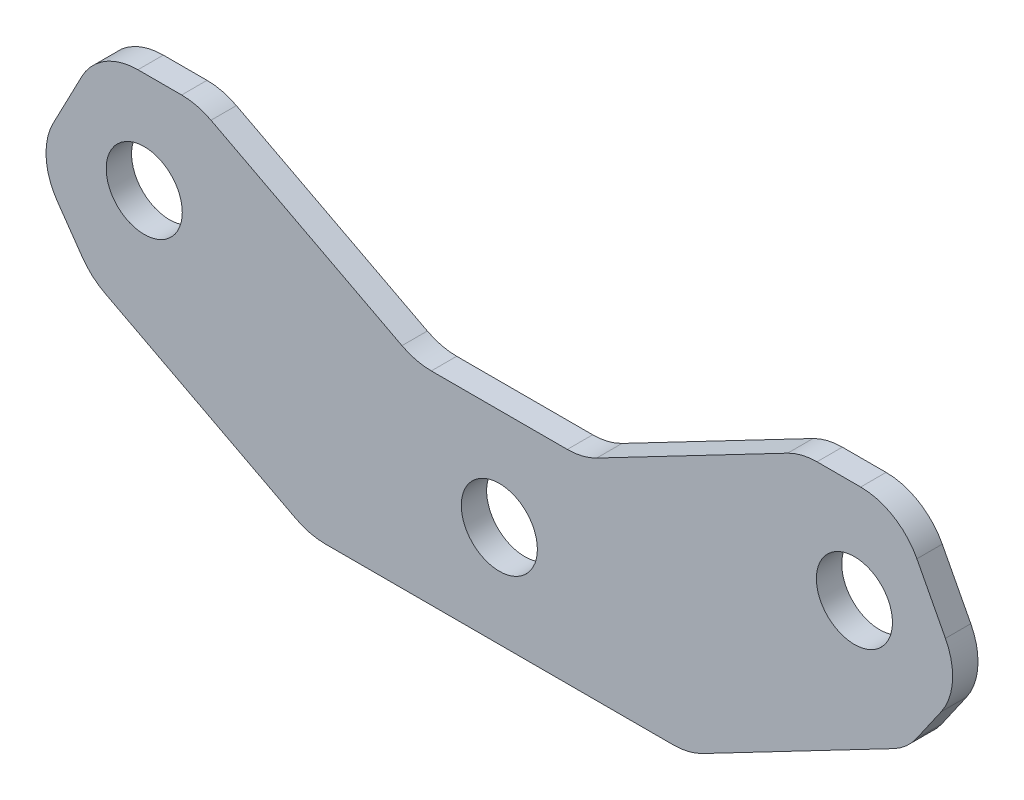
ISO-10303-21;
HEADER;
FILE_DESCRIPTION(('STEP AP214'),'2;1');
FILE_NAME('part.step','',(''),(''),'','','');
FILE_SCHEMA(('AUTOMOTIVE_DESIGN { 1 0 10303 214 1 1 1 1 }'));
ENDSEC;
DATA;
#1=APPLICATION_CONTEXT('core data for automotive mechanical design processes');
#2=APPLICATION_PROTOCOL_DEFINITION('international standard','automotive_design',2000,#1);
#3=PRODUCT_CONTEXT('',#1,'mechanical');
#4=PRODUCT('Part','Part','',(#3));
#5=PRODUCT_RELATED_PRODUCT_CATEGORY('part','',(#4));
#6=PRODUCT_DEFINITION_FORMATION('','',#4);
#7=PRODUCT_DEFINITION_CONTEXT('part definition',#1,'design');
#8=PRODUCT_DEFINITION('design','',#6,#7);
#9=PRODUCT_DEFINITION_SHAPE('','',#8);
#10=(LENGTH_UNIT() NAMED_UNIT(*) SI_UNIT(.MILLI.,.METRE.));
#11=(NAMED_UNIT(*) PLANE_ANGLE_UNIT() SI_UNIT($,.RADIAN.));
#12=(NAMED_UNIT(*) SI_UNIT($,.STERADIAN.) SOLID_ANGLE_UNIT());
#13=UNCERTAINTY_MEASURE_WITH_UNIT(LENGTH_MEASURE(1.E-05),#10,'distance_accuracy_value','');
#14=(GEOMETRIC_REPRESENTATION_CONTEXT(3) GLOBAL_UNCERTAINTY_ASSIGNED_CONTEXT((#13)) GLOBAL_UNIT_ASSIGNED_CONTEXT((#10,
#11,#12)) REPRESENTATION_CONTEXT('',''));
#15=CARTESIAN_POINT('',(0.,0.,0.));
#16=DIRECTION('',(0.,0.,1.));
#17=DIRECTION('',(1.,0.,0.));
#18=AXIS2_PLACEMENT_3D('',#15,#16,#17);
#19=CARTESIAN_POINT('',(0.,8.,2.));
#20=DIRECTION('',(0.,1.,0.));
#21=DIRECTION('',(0.,0.,1.));
#22=AXIS2_PLACEMENT_3D('',#19,#20,#21);
#23=PLANE('',#22);
#24=DIRECTION('',(1.,0.,0.));
#25=VECTOR('',#24,1.);
#26=CARTESIAN_POINT('',(0.,8.,2.));
#27=LINE('',#26,#25);
#28=CARTESIAN_POINT('',(-5.36175130361529,8.,2.));
#29=VERTEX_POINT('',#28);
#30=CARTESIAN_POINT('',(5.36175130361529,8.,2.));
#31=VERTEX_POINT('',#30);
#32=EDGE_CURVE('E345',#29,#31,#27,.T.);
#33=ORIENTED_EDGE('',*,*,#32,.T.);
#34=DIRECTION('',(0.,0.,-1.));
#35=VECTOR('',#34,1.);
#36=CARTESIAN_POINT('',(5.36175130361529,8.,0.));
#37=LINE('',#36,#35);
#38=CARTESIAN_POINT('',(5.36175130361529,8.,0.));
#39=VERTEX_POINT('',#38);
#40=EDGE_CURVE('E300',#31,#39,#37,.T.);
#41=ORIENTED_EDGE('',*,*,#40,.T.);
#42=DIRECTION('',(1.,0.,0.));
#43=VECTOR('',#42,1.);
#44=CARTESIAN_POINT('',(0.,8.,0.));
#45=LINE('',#44,#43);
#46=CARTESIAN_POINT('',(-5.36175130361529,8.,0.));
#47=VERTEX_POINT('',#46);
#48=EDGE_CURVE('E324',#47,#39,#45,.T.);
#49=ORIENTED_EDGE('',*,*,#48,.F.);
#50=DIRECTION('',(0.,0.,-1.));
#51=VECTOR('',#50,1.);
#52=CARTESIAN_POINT('',(-5.36175130361529,8.,2.));
#53=LINE('',#52,#51);
#54=EDGE_CURVE('E298',#47,#29,#53,.F.);
#55=ORIENTED_EDGE('',*,*,#54,.T.);
#56=EDGE_LOOP('',(#33,#41,#49,#55));
#57=FACE_BOUND('',#56,.T.);
#58=ADVANCED_FACE('F35',(#57),#23,.T.);
#59=CARTESIAN_POINT('',(1.87072696465954,3.58208967660546,2.));
#60=DIRECTION('',(-0.462918146168769,-0.886401032235224,0.));
#61=DIRECTION('',(0.886401032235224,-0.462918146168769,0.));
#62=AXIS2_PLACEMENT_3D('',#59,#60,#61);
#63=PLANE('',#62);
#64=DIRECTION('',(-0.886401032235224,0.462918146168769,0.));
#65=VECTOR('',#64,1.);
#66=CARTESIAN_POINT('',(1.87072696465954,3.58208967660546,2.));
#67=LINE('',#66,#65);
#68=CARTESIAN_POINT('',(-7.67634203445913,8.56799483882388,2.));
#69=VERTEX_POINT('',#68);
#70=CARTESIAN_POINT('',(-22.7344401559791,16.4320051611761,2.));
#71=VERTEX_POINT('',#70);
#72=EDGE_CURVE('E343',#69,#71,#67,.T.);
#73=ORIENTED_EDGE('',*,*,#72,.F.);
#74=DIRECTION('',(0.,0.,-1.));
#75=VECTOR('',#74,1.);
#76=CARTESIAN_POINT('',(-7.67634203445913,8.56799483882388,2.));
#77=LINE('',#76,#75);
#78=CARTESIAN_POINT('',(-7.67634203445913,8.56799483882388,0.));
#79=VERTEX_POINT('',#78);
#80=EDGE_CURVE('E305',#69,#79,#77,.T.);
#81=ORIENTED_EDGE('',*,*,#80,.T.);
#82=DIRECTION('',(-0.886401032235224,0.462918146168769,0.));
#83=VECTOR('',#82,1.);
#84=CARTESIAN_POINT('',(1.87072696465954,3.58208967660546,0.));
#85=LINE('',#84,#83);
#86=CARTESIAN_POINT('',(-22.7344401559791,16.4320051611761,0.));
#87=VERTEX_POINT('',#86);
#88=EDGE_CURVE('E326',#79,#87,#85,.T.);
#89=ORIENTED_EDGE('',*,*,#88,.T.);
#90=DIRECTION('',(0.,0.,-1.));
#91=VECTOR('',#90,1.);
#92=CARTESIAN_POINT('',(-22.7344401559791,16.4320051611761,2.));
#93=LINE('',#92,#91);
#94=EDGE_CURVE('E303',#87,#71,#93,.F.);
#95=ORIENTED_EDGE('',*,*,#94,.T.);
#96=EDGE_LOOP('',(#73,#81,#89,#95));
#97=FACE_BOUND('',#96,.T.);
#98=ADVANCED_FACE('F347',(#97),#63,.F.);
#99=CARTESIAN_POINT('',(0.,17.,2.));
#100=DIRECTION('',(0.,-1.,0.));
#101=DIRECTION('',(0.,0.,-1.));
#102=AXIS2_PLACEMENT_3D('',#99,#100,#101);
#103=PLANE('',#102);
#104=DIRECTION('',(-1.,0.,0.));
#105=VECTOR('',#104,1.);
#106=CARTESIAN_POINT('',(0.,17.,2.));
#107=LINE('',#106,#105);
#108=CARTESIAN_POINT('',(-25.049030886823,17.,2.));
#109=VERTEX_POINT('',#108);
#110=CARTESIAN_POINT('',(-28.4956474202711,17.,2.));
#111=VERTEX_POINT('',#110);
#112=EDGE_CURVE('E349',#109,#111,#107,.T.);
#113=ORIENTED_EDGE('',*,*,#112,.F.);
#114=DIRECTION('',(0.,0.,-1.));
#115=VECTOR('',#114,1.);
#116=CARTESIAN_POINT('',(-25.049030886823,17.,2.));
#117=LINE('',#116,#115);
#118=CARTESIAN_POINT('',(-25.049030886823,17.,0.));
#119=VERTEX_POINT('',#118);
#120=EDGE_CURVE('E310',#109,#119,#117,.T.);
#121=ORIENTED_EDGE('',*,*,#120,.T.);
#122=DIRECTION('',(-1.,0.,0.));
#123=VECTOR('',#122,1.);
#124=CARTESIAN_POINT('',(0.,17.,0.));
#125=LINE('',#124,#123);
#126=CARTESIAN_POINT('',(-28.4956474202711,17.,0.));
#127=VERTEX_POINT('',#126);
#128=EDGE_CURVE('E387',#119,#127,#125,.T.);
#129=ORIENTED_EDGE('',*,*,#128,.T.);
#130=DIRECTION('',(0.,0.,-1.));
#131=VECTOR('',#130,1.);
#132=CARTESIAN_POINT('',(-28.4956474202711,17.,2.));
#133=LINE('',#132,#131);
#134=EDGE_CURVE('E308',#127,#111,#133,.F.);
#135=ORIENTED_EDGE('',*,*,#134,.T.);
#136=EDGE_LOOP('',(#113,#121,#129,#135));
#137=FACE_BOUND('',#136,.T.);
#138=ADVANCED_FACE('F441',(#137),#103,.F.);
#139=CARTESIAN_POINT('',(-31.7452022944909,16.5787602467712,2.));
#140=DIRECTION('',(0.886401032235224,-0.462918146168768,0.));
#141=DIRECTION('',(0.462918146168768,0.886401032235224,0.));
#142=AXIS2_PLACEMENT_3D('',#139,#140,#141);
#143=PLANE('',#142);
#144=DIRECTION('',(-0.462918146168768,-0.886401032235224,0.));
#145=VECTOR('',#144,1.);
#146=CARTESIAN_POINT('',(-31.7452022944909,16.5787602467712,0.));
#147=LINE('',#146,#145);
#148=CARTESIAN_POINT('',(-32.9276525814472,14.3145907308438,0.));
#149=VERTEX_POINT('',#148);
#150=CARTESIAN_POINT('',(-35.1772115635856,10.0071091159095,0.));
#151=VERTEX_POINT('',#150);
#152=EDGE_CURVE('E390',#149,#151,#147,.T.);
#153=ORIENTED_EDGE('',*,*,#152,.T.);
#154=DIRECTION('',(0.,0.,-1.));
#155=VECTOR('',#154,1.);
#156=CARTESIAN_POINT('',(-35.1772115635856,10.0071091159095,2.));
#157=LINE('',#156,#155);
#158=CARTESIAN_POINT('',(-35.1772115635856,10.0071091159095,2.));
#159=VERTEX_POINT('',#158);
#160=EDGE_CURVE('E316',#151,#159,#157,.F.);
#161=ORIENTED_EDGE('',*,*,#160,.T.);
#162=DIRECTION('',(-0.462918146168768,-0.886401032235224,0.));
#163=VECTOR('',#162,1.);
#164=CARTESIAN_POINT('',(-31.7452022944909,16.5787602467712,2.));
#165=LINE('',#164,#163);
#166=CARTESIAN_POINT('',(-32.9276525814472,14.3145907308438,2.));
#167=VERTEX_POINT('',#166);
#168=EDGE_CURVE('E352',#167,#159,#165,.T.);
#169=ORIENTED_EDGE('',*,*,#168,.F.);
#170=DIRECTION('',(0.,0.,-1.));
#171=VECTOR('',#170,1.);
#172=CARTESIAN_POINT('',(-32.9276525814472,14.3145907308438,2.));
#173=LINE('',#172,#171);
#174=EDGE_CURVE('E313',#167,#149,#173,.T.);
#175=ORIENTED_EDGE('',*,*,#174,.T.);
#176=EDGE_LOOP('',(#153,#161,#169,#175));
#177=FACE_BOUND('',#176,.T.);
#178=ADVANCED_FACE('F537',(#177),#143,.F.);
#179=CARTESIAN_POINT('',(-21.2024825788065,-14.7629387653157,2.));
#180=DIRECTION('',(0.820662245208827,0.571413579895339,0.));
#181=DIRECTION('',(-0.571413579895339,0.820662245208827,0.));
#182=AXIS2_PLACEMENT_3D('',#179,#180,#181);
#183=PLANE('',#182);
#184=DIRECTION('',(0.571413579895339,-0.820662245208827,0.));
#185=VECTOR('',#184,1.);
#186=CARTESIAN_POINT('',(-21.2024825788065,-14.7629387653157,0.));
#187=LINE('',#186,#185);
#188=CARTESIAN_POINT('',(-34.8485176284536,4.83545048558895,0.));
#189=VERTEX_POINT('',#188);
#190=CARTESIAN_POINT('',(-32.8790741365496,2.00694242287555,0.));
#191=VERTEX_POINT('',#190);
#192=EDGE_CURVE('E393',#189,#191,#187,.T.);
#193=ORIENTED_EDGE('',*,*,#192,.T.);
#194=DIRECTION('',(0.,0.,-1.));
#195=VECTOR('',#194,1.);
#196=CARTESIAN_POINT('',(-32.8790741365496,2.00694242287554,2.));
#197=LINE('',#196,#195);
#198=CARTESIAN_POINT('',(-32.8790741365496,2.00694242287555,2.));
#199=VERTEX_POINT('',#198);
#200=EDGE_CURVE('E278',#191,#199,#197,.F.);
#201=ORIENTED_EDGE('',*,*,#200,.T.);
#202=DIRECTION('',(0.571413579895339,-0.820662245208827,0.));
#203=VECTOR('',#202,1.);
#204=CARTESIAN_POINT('',(-21.2024825788065,-14.7629387653157,2.));
#205=LINE('',#204,#203);
#206=CARTESIAN_POINT('',(-34.8485176284536,4.83545048558895,2.));
#207=VERTEX_POINT('',#206);
#208=EDGE_CURVE('E360',#207,#199,#205,.T.);
#209=ORIENTED_EDGE('',*,*,#208,.F.);
#210=DIRECTION('',(0.,0.,-1.));
#211=VECTOR('',#210,1.);
#212=CARTESIAN_POINT('',(-34.8485176284536,4.83545048558896,2.));
#213=LINE('',#212,#211);
#214=EDGE_CURVE('E275',#207,#189,#213,.T.);
#215=ORIENTED_EDGE('',*,*,#214,.T.);
#216=EDGE_LOOP('',(#193,#201,#209,#215));
#217=FACE_BOUND('',#216,.T.);
#218=ADVANCED_FACE('F498',(#217),#183,.F.);
#219=CARTESIAN_POINT('',(-6.48518652071058,-12.4179103233945,2.));
#220=DIRECTION('',(0.462918146168769,0.886401032235224,0.));
#221=DIRECTION('',(-0.886401032235224,0.462918146168769,0.));
#222=AXIS2_PLACEMENT_3D('',#219,#220,#221);
#223=PLANE('',#222);
#224=DIRECTION('',(0.886401032235224,-0.462918146168769,0.));
#225=VECTOR('',#224,1.);
#226=CARTESIAN_POINT('',(-6.48518652071058,-12.4179103233945,2.));
#227=LINE('',#226,#225);
#228=CARTESIAN_POINT('',(-31.0903536413493,0.432005161176122,2.));
#229=VERTEX_POINT('',#228);
#230=CARTESIAN_POINT('',(-16.0322555198292,-7.43200516117612,2.));
#231=VERTEX_POINT('',#230);
#232=EDGE_CURVE('E363',#229,#231,#227,.T.);
#233=ORIENTED_EDGE('',*,*,#232,.F.);
#234=DIRECTION('',(0.,0.,-1.));
#235=VECTOR('',#234,1.);
#236=CARTESIAN_POINT('',(-31.0903536413493,0.43200516117612,2.));
#237=LINE('',#236,#235);
#238=CARTESIAN_POINT('',(-31.0903536413493,0.432005161176122,0.));
#239=VERTEX_POINT('',#238);
#240=EDGE_CURVE('E272',#229,#239,#237,.T.);
#241=ORIENTED_EDGE('',*,*,#240,.T.);
#242=DIRECTION('',(0.886401032235224,-0.462918146168769,0.));
#243=VECTOR('',#242,1.);
#244=CARTESIAN_POINT('',(-6.48518652071058,-12.4179103233945,0.));
#245=LINE('',#244,#243);
#246=CARTESIAN_POINT('',(-16.0322555198292,-7.43200516117612,0.));
#247=VERTEX_POINT('',#246);
#248=EDGE_CURVE('E396',#239,#247,#245,.T.);
#249=ORIENTED_EDGE('',*,*,#248,.T.);
#250=DIRECTION('',(0.,0.,-1.));
#251=VECTOR('',#250,1.);
#252=CARTESIAN_POINT('',(-16.0322555198292,-7.43200516117612,2.));
#253=LINE('',#252,#251);
#254=EDGE_CURVE('E270',#247,#231,#253,.F.);
#255=ORIENTED_EDGE('',*,*,#254,.T.);
#256=EDGE_LOOP('',(#233,#241,#249,#255));
#257=FACE_BOUND('',#256,.T.);
#258=ADVANCED_FACE('F505',(#257),#223,.F.);
#259=CARTESIAN_POINT('',(0.,-8.,2.));
#260=DIRECTION('',(0.,1.,0.));
#261=DIRECTION('',(0.,0.,1.));
#262=AXIS2_PLACEMENT_3D('',#259,#260,#261);
#263=PLANE('',#262);
#264=DIRECTION('',(1.,0.,0.));
#265=VECTOR('',#264,1.);
#266=CARTESIAN_POINT('',(0.,-8.,2.));
#267=LINE('',#266,#265);
#268=CARTESIAN_POINT('',(-13.7176647889854,-8.,2.));
#269=VERTEX_POINT('',#268);
#270=CARTESIAN_POINT('',(13.7176647889854,-8.,2.));
#271=VERTEX_POINT('',#270);
#272=EDGE_CURVE('E366',#269,#271,#267,.T.);
#273=ORIENTED_EDGE('',*,*,#272,.F.);
#274=DIRECTION('',(0.,0.,-1.));
#275=VECTOR('',#274,1.);
#276=CARTESIAN_POINT('',(-13.7176647889854,-8.,2.));
#277=LINE('',#276,#275);
#278=CARTESIAN_POINT('',(-13.7176647889854,-8.,0.));
#279=VERTEX_POINT('',#278);
#280=EDGE_CURVE('E282',#269,#279,#277,.T.);
#281=ORIENTED_EDGE('',*,*,#280,.T.);
#282=DIRECTION('',(1.,0.,0.));
#283=VECTOR('',#282,1.);
#284=CARTESIAN_POINT('',(0.,-8.,0.));
#285=LINE('',#284,#283);
#286=CARTESIAN_POINT('',(13.7176647889854,-8.,0.));
#287=VERTEX_POINT('',#286);
#288=EDGE_CURVE('E399',#279,#287,#285,.T.);
#289=ORIENTED_EDGE('',*,*,#288,.T.);
#290=DIRECTION('',(0.,0.,-1.));
#291=VECTOR('',#290,1.);
#292=CARTESIAN_POINT('',(13.7176647889854,-8.,2.));
#293=LINE('',#292,#291);
#294=EDGE_CURVE('E280',#287,#271,#293,.F.);
#295=ORIENTED_EDGE('',*,*,#294,.T.);
#296=EDGE_LOOP('',(#273,#281,#289,#295));
#297=FACE_BOUND('',#296,.T.);
#298=ADVANCED_FACE('F512',(#297),#263,.F.);
#299=CARTESIAN_POINT('',(6.48518652071058,-12.4179103233945,2.));
#300=DIRECTION('',(0.462918146168769,-0.886401032235224,0.));
#301=DIRECTION('',(0.886401032235224,0.462918146168769,0.));
#302=AXIS2_PLACEMENT_3D('',#299,#300,#301);
#303=PLANE('',#302);
#304=DIRECTION('',(-0.886401032235224,-0.462918146168769,0.));
#305=VECTOR('',#304,1.);
#306=CARTESIAN_POINT('',(6.48518652071058,-12.4179103233945,2.));
#307=LINE('',#306,#305);
#308=CARTESIAN_POINT('',(31.0903536413493,0.43200516117612,2.));
#309=VERTEX_POINT('',#308);
#310=CARTESIAN_POINT('',(16.0322555198292,-7.43200516117612,2.));
#311=VERTEX_POINT('',#310);
#312=EDGE_CURVE('E369',#309,#311,#307,.T.);
#313=ORIENTED_EDGE('',*,*,#312,.T.);
#314=DIRECTION('',(0.,0.,-1.));
#315=VECTOR('',#314,1.);
#316=CARTESIAN_POINT('',(16.0322555198292,-7.43200516117612,0.));
#317=LINE('',#316,#315);
#318=CARTESIAN_POINT('',(16.0322555198292,-7.43200516117612,0.));
#319=VERTEX_POINT('',#318);
#320=EDGE_CURVE('E287',#311,#319,#317,.T.);
#321=ORIENTED_EDGE('',*,*,#320,.T.);
#322=DIRECTION('',(-0.886401032235224,-0.462918146168769,0.));
#323=VECTOR('',#322,1.);
#324=CARTESIAN_POINT('',(6.48518652071058,-12.4179103233945,0.));
#325=LINE('',#324,#323);
#326=CARTESIAN_POINT('',(31.0903536413493,0.43200516117612,0.));
#327=VERTEX_POINT('',#326);
#328=EDGE_CURVE('E402',#327,#319,#325,.T.);
#329=ORIENTED_EDGE('',*,*,#328,.F.);
#330=DIRECTION('',(0.,0.,-1.));
#331=VECTOR('',#330,1.);
#332=CARTESIAN_POINT('',(31.0903536413493,0.432005161176117,2.));
#333=LINE('',#332,#331);
#334=EDGE_CURVE('E285',#327,#309,#333,.F.);
#335=ORIENTED_EDGE('',*,*,#334,.T.);
#336=EDGE_LOOP('',(#313,#321,#329,#335));
#337=FACE_BOUND('',#336,.T.);
#338=ADVANCED_FACE('F519',(#337),#303,.T.);
#339=CARTESIAN_POINT('',(21.2024825788065,-14.7629387653157,2.));
#340=DIRECTION('',(0.820662245208827,-0.571413579895339,0.));
#341=DIRECTION('',(0.571413579895339,0.820662245208827,0.));
#342=AXIS2_PLACEMENT_3D('',#339,#340,#341);
#343=PLANE('',#342);
#344=DIRECTION('',(-0.571413579895339,-0.820662245208827,0.));
#345=VECTOR('',#344,1.);
#346=CARTESIAN_POINT('',(21.2024825788065,-14.7629387653157,2.));
#347=LINE('',#346,#345);
#348=CARTESIAN_POINT('',(34.8485176284536,4.83545048558895,2.));
#349=VERTEX_POINT('',#348);
#350=CARTESIAN_POINT('',(32.8790741365496,2.00694242287554,2.));
#351=VERTEX_POINT('',#350);
#352=EDGE_CURVE('E372',#349,#351,#347,.T.);
#353=ORIENTED_EDGE('',*,*,#352,.T.);
#354=DIRECTION('',(0.,0.,-1.));
#355=VECTOR('',#354,1.);
#356=CARTESIAN_POINT('',(32.8790741365496,2.00694242287554,2.));
#357=LINE('',#356,#355);
#358=CARTESIAN_POINT('',(32.8790741365496,2.00694242287554,0.));
#359=VERTEX_POINT('',#358);
#360=EDGE_CURVE('E292',#351,#359,#357,.T.);
#361=ORIENTED_EDGE('',*,*,#360,.T.);
#362=DIRECTION('',(-0.571413579895339,-0.820662245208827,0.));
#363=VECTOR('',#362,1.);
#364=CARTESIAN_POINT('',(21.2024825788065,-14.7629387653157,0.));
#365=LINE('',#364,#363);
#366=CARTESIAN_POINT('',(34.8485176284536,4.83545048558895,0.));
#367=VERTEX_POINT('',#366);
#368=EDGE_CURVE('E405',#367,#359,#365,.T.);
#369=ORIENTED_EDGE('',*,*,#368,.F.);
#370=DIRECTION('',(0.,0.,-1.));
#371=VECTOR('',#370,1.);
#372=CARTESIAN_POINT('',(34.8485176284536,4.83545048558895,2.));
#373=LINE('',#372,#371);
#374=EDGE_CURVE('E290',#367,#349,#373,.F.);
#375=ORIENTED_EDGE('',*,*,#374,.T.);
#376=EDGE_LOOP('',(#353,#361,#369,#375));
#377=FACE_BOUND('',#376,.T.);
#378=ADVANCED_FACE('F526',(#377),#343,.T.);
#379=CARTESIAN_POINT('',(31.7452022944909,16.5787602467712,2.));
#380=DIRECTION('',(0.886401032235224,0.462918146168768,0.));
#381=DIRECTION('',(-0.462918146168768,0.886401032235224,0.));
#382=AXIS2_PLACEMENT_3D('',#379,#380,#381);
#383=PLANE('',#382);
#384=DIRECTION('',(0.462918146168768,-0.886401032235224,0.));
#385=VECTOR('',#384,1.);
#386=CARTESIAN_POINT('',(31.7452022944909,16.5787602467712,0.));
#387=LINE('',#386,#385);
#388=CARTESIAN_POINT('',(32.9276525814472,14.3145907308438,0.));
#389=VERTEX_POINT('',#388);
#390=CARTESIAN_POINT('',(35.1772115635856,10.0071091159095,0.));
#391=VERTEX_POINT('',#390);
#392=EDGE_CURVE('E217',#389,#391,#387,.T.);
#393=ORIENTED_EDGE('',*,*,#392,.F.);
#394=DIRECTION('',(0.,0.,-1.));
#395=VECTOR('',#394,1.);
#396=CARTESIAN_POINT('',(32.9276525814472,14.3145907308438,2.));
#397=LINE('',#396,#395);
#398=CARTESIAN_POINT('',(32.9276525814472,14.3145907308438,2.));
#399=VERTEX_POINT('',#398);
#400=EDGE_CURVE('E249',#389,#399,#397,.F.);
#401=ORIENTED_EDGE('',*,*,#400,.T.);
#402=DIRECTION('',(0.462918146168768,-0.886401032235224,0.));
#403=VECTOR('',#402,1.);
#404=CARTESIAN_POINT('',(31.7452022944909,16.5787602467712,2.));
#405=LINE('',#404,#403);
#406=CARTESIAN_POINT('',(35.1772115635856,10.0071091159095,2.));
#407=VERTEX_POINT('',#406);
#408=EDGE_CURVE('E375',#399,#407,#405,.T.);
#409=ORIENTED_EDGE('',*,*,#408,.T.);
#410=DIRECTION('',(0.,0.,-1.));
#411=VECTOR('',#410,1.);
#412=CARTESIAN_POINT('',(35.1772115635856,10.0071091159095,2.));
#413=LINE('',#412,#411);
#414=EDGE_CURVE('E246',#407,#391,#413,.T.);
#415=ORIENTED_EDGE('',*,*,#414,.T.);
#416=EDGE_LOOP('',(#393,#401,#409,#415));
#417=FACE_BOUND('',#416,.T.);
#418=ADVANCED_FACE('F533',(#417),#383,.T.);
#419=CARTESIAN_POINT('',(0.,17.,2.));
#420=DIRECTION('',(0.,1.,0.));
#421=DIRECTION('',(0.,0.,1.));
#422=AXIS2_PLACEMENT_3D('',#419,#420,#421);
#423=PLANE('',#422);
#424=DIRECTION('',(1.,0.,0.));
#425=VECTOR('',#424,1.);
#426=CARTESIAN_POINT('',(0.,17.,2.));
#427=LINE('',#426,#425);
#428=CARTESIAN_POINT('',(25.049030886823,17.,2.));
#429=VERTEX_POINT('',#428);
#430=CARTESIAN_POINT('',(28.4956474202711,17.,2.));
#431=VERTEX_POINT('',#430);
#432=EDGE_CURVE('E378',#429,#431,#427,.T.);
#433=ORIENTED_EDGE('',*,*,#432,.T.);
#434=DIRECTION('',(0.,0.,-1.));
#435=VECTOR('',#434,1.);
#436=CARTESIAN_POINT('',(28.4956474202711,17.,2.));
#437=LINE('',#436,#435);
#438=CARTESIAN_POINT('',(28.4956474202711,17.,0.));
#439=VERTEX_POINT('',#438);
#440=EDGE_CURVE('E216',#431,#439,#437,.T.);
#441=ORIENTED_EDGE('',*,*,#440,.T.);
#442=DIRECTION('',(1.,0.,0.));
#443=VECTOR('',#442,1.);
#444=CARTESIAN_POINT('',(0.,17.,0.));
#445=LINE('',#444,#443);
#446=CARTESIAN_POINT('',(25.049030886823,17.,0.));
#447=VERTEX_POINT('',#446);
#448=EDGE_CURVE('E201',#447,#439,#445,.T.);
#449=ORIENTED_EDGE('',*,*,#448,.F.);
#450=DIRECTION('',(0.,0.,-1.));
#451=VECTOR('',#450,1.);
#452=CARTESIAN_POINT('',(25.049030886823,17.,2.));
#453=LINE('',#452,#451);
#454=EDGE_CURVE('E214',#447,#429,#453,.F.);
#455=ORIENTED_EDGE('',*,*,#454,.T.);
#456=EDGE_LOOP('',(#433,#441,#449,#455));
#457=FACE_BOUND('',#456,.T.);
#458=ADVANCED_FACE('F213',(#457),#423,.T.);
#459=CARTESIAN_POINT('',(-1.87072696465954,3.58208967660546,2.));
#460=DIRECTION('',(-0.462918146168769,0.886401032235224,0.));
#461=DIRECTION('',(-0.886401032235224,-0.462918146168769,0.));
#462=AXIS2_PLACEMENT_3D('',#459,#460,#461);
#463=PLANE('',#462);
#464=DIRECTION('',(0.886401032235224,0.462918146168769,0.));
#465=VECTOR('',#464,1.);
#466=CARTESIAN_POINT('',(-1.87072696465954,3.58208967660546,2.));
#467=LINE('',#466,#465);
#468=CARTESIAN_POINT('',(7.67634203445913,8.56799483882388,2.));
#469=VERTEX_POINT('',#468);
#470=CARTESIAN_POINT('',(22.7344401559791,16.4320051611761,2.));
#471=VERTEX_POINT('',#470);
#472=EDGE_CURVE('E225',#469,#471,#467,.T.);
#473=ORIENTED_EDGE('',*,*,#472,.T.);
#474=DIRECTION('',(0.,0.,-1.));
#475=VECTOR('',#474,1.);
#476=CARTESIAN_POINT('',(22.7344401559792,16.4320051611761,2.));
#477=LINE('',#476,#475);
#478=CARTESIAN_POINT('',(22.7344401559791,16.4320051611761,0.));
#479=VERTEX_POINT('',#478);
#480=EDGE_CURVE('E296',#471,#479,#477,.T.);
#481=ORIENTED_EDGE('',*,*,#480,.T.);
#482=DIRECTION('',(0.886401032235224,0.462918146168769,0.));
#483=VECTOR('',#482,1.);
#484=CARTESIAN_POINT('',(-1.87072696465954,3.58208967660546,0.));
#485=LINE('',#484,#483);
#486=CARTESIAN_POINT('',(7.67634203445913,8.56799483882388,0.));
#487=VERTEX_POINT('',#486);
#488=EDGE_CURVE('E202',#487,#479,#485,.T.);
#489=ORIENTED_EDGE('',*,*,#488,.F.);
#490=DIRECTION('',(0.,0.,-1.));
#491=VECTOR('',#490,1.);
#492=CARTESIAN_POINT('',(7.67634203445913,8.56799483882388,2.));
#493=LINE('',#492,#491);
#494=EDGE_CURVE('E57',#487,#469,#493,.F.);
#495=ORIENTED_EDGE('',*,*,#494,.T.);
#496=EDGE_LOOP('',(#473,#481,#489,#495));
#497=FACE_BOUND('',#496,.T.);
#498=ADVANCED_FACE('F447',(#497),#463,.T.);
#499=CARTESIAN_POINT('',(0.,0.,2.));
#500=DIRECTION('',(0.,0.,-1.));
#501=DIRECTION('',(-1.,0.,0.));
#502=AXIS2_PLACEMENT_3D('',#499,#500,#501);
#503=CYLINDRICAL_SURFACE('',#502,3.);
#504=CARTESIAN_POINT('',(0.,0.,2.));
#505=DIRECTION('',(0.,0.,1.));
#506=DIRECTION('',(1.,0.,0.));
#507=AXIS2_PLACEMENT_3D('',#504,#505,#506);
#508=CIRCLE('',#507,3.);
#509=CARTESIAN_POINT('',(3.,0.,2.));
#510=VERTEX_POINT('',#509);
#511=EDGE_CURVE('E354',#510,#510,#508,.T.);
#512=ORIENTED_EDGE('',*,*,#511,.T.);
#513=EDGE_LOOP('',(#512));
#514=FACE_BOUND('',#513,.T.);
#515=CARTESIAN_POINT('',(0.,0.,0.));
#516=DIRECTION('',(0.,0.,1.));
#517=DIRECTION('',(1.,0.,0.));
#518=AXIS2_PLACEMENT_3D('',#515,#516,#517);
#519=CIRCLE('',#518,3.);
#520=CARTESIAN_POINT('',(3.,0.,0.));
#521=VERTEX_POINT('',#520);
#522=EDGE_CURVE('E334',#521,#521,#519,.T.);
#523=ORIENTED_EDGE('',*,*,#522,.F.);
#524=EDGE_LOOP('',(#523));
#525=FACE_BOUND('',#524,.T.);
#526=ADVANCED_FACE('F419',(#514,#525),#503,.F.);
#527=CARTESIAN_POINT('',(-28.,9.,2.));
#528=DIRECTION('',(0.,0.,-1.));
#529=DIRECTION('',(-1.,0.,0.));
#530=AXIS2_PLACEMENT_3D('',#527,#528,#529);
#531=CYLINDRICAL_SURFACE('',#530,3.);
#532=CARTESIAN_POINT('',(-28.,9.,2.));
#533=DIRECTION('',(0.,0.,1.));
#534=DIRECTION('',(1.,0.,0.));
#535=AXIS2_PLACEMENT_3D('',#532,#533,#534);
#536=CIRCLE('',#535,3.);
#537=CARTESIAN_POINT('',(-25.,9.,2.));
#538=VERTEX_POINT('',#537);
#539=EDGE_CURVE('E410',#538,#538,#536,.T.);
#540=ORIENTED_EDGE('',*,*,#539,.T.);
#541=EDGE_LOOP('',(#540));
#542=FACE_BOUND('',#541,.T.);
#543=CARTESIAN_POINT('',(-28.,9.,0.));
#544=DIRECTION('',(0.,0.,1.));
#545=DIRECTION('',(1.,0.,0.));
#546=AXIS2_PLACEMENT_3D('',#543,#544,#545);
#547=CIRCLE('',#546,3.);
#548=CARTESIAN_POINT('',(-25.,9.,0.));
#549=VERTEX_POINT('',#548);
#550=EDGE_CURVE('E381',#549,#549,#547,.T.);
#551=ORIENTED_EDGE('',*,*,#550,.F.);
#552=EDGE_LOOP('',(#551));
#553=FACE_BOUND('',#552,.T.);
#554=ADVANCED_FACE('F433',(#542,#553),#531,.F.);
#555=CARTESIAN_POINT('',(28.,9.,2.));
#556=DIRECTION('',(0.,0.,-1.));
#557=DIRECTION('',(-1.,0.,0.));
#558=AXIS2_PLACEMENT_3D('',#555,#556,#557);
#559=CYLINDRICAL_SURFACE('',#558,2.99999999999999);
#560=CARTESIAN_POINT('',(28.,9.,2.));
#561=DIRECTION('',(0.,0.,1.));
#562=DIRECTION('',(1.,0.,0.));
#563=AXIS2_PLACEMENT_3D('',#560,#561,#562);
#564=CIRCLE('',#563,2.99999999999999);
#565=CARTESIAN_POINT('',(31.,9.,2.));
#566=VERTEX_POINT('',#565);
#567=EDGE_CURVE('E220',#566,#566,#564,.T.);
#568=ORIENTED_EDGE('',*,*,#567,.T.);
#569=EDGE_LOOP('',(#568));
#570=FACE_BOUND('',#569,.T.);
#571=CARTESIAN_POINT('',(28.,9.,0.));
#572=DIRECTION('',(0.,0.,1.));
#573=DIRECTION('',(1.,0.,0.));
#574=AXIS2_PLACEMENT_3D('',#571,#572,#573);
#575=CIRCLE('',#574,2.99999999999999);
#576=CARTESIAN_POINT('',(31.,9.,0.));
#577=VERTEX_POINT('',#576);
#578=EDGE_CURVE('E228',#577,#577,#575,.T.);
#579=ORIENTED_EDGE('',*,*,#578,.F.);
#580=EDGE_LOOP('',(#579));
#581=FACE_BOUND('',#580,.T.);
#582=ADVANCED_FACE('F423',(#570,#581),#559,.F.);
#583=CARTESIAN_POINT('',(0.,0.,2.));
#584=DIRECTION('',(0.,0.,1.));
#585=DIRECTION('',(1.,0.,0.));
#586=AXIS2_PLACEMENT_3D('',#583,#584,#585);
#587=PLANE('',#586);
#588=ORIENTED_EDGE('',*,*,#539,.F.);
#589=EDGE_LOOP('',(#588));
#590=FACE_BOUND('',#589,.T.);
#591=ORIENTED_EDGE('',*,*,#511,.F.);
#592=EDGE_LOOP('',(#591));
#593=FACE_BOUND('',#592,.T.);
#594=ORIENTED_EDGE('',*,*,#408,.F.);
#595=CARTESIAN_POINT('',(28.4956474202711,12.,2.));
#596=DIRECTION('',(0.,0.,1.));
#597=DIRECTION('',(1.,0.,0.));
#598=AXIS2_PLACEMENT_3D('',#595,#596,#597);
#599=CIRCLE('',#598,5.);
#600=EDGE_CURVE('E268',#399,#431,#599,.T.);
#601=ORIENTED_EDGE('',*,*,#600,.T.);
#602=ORIENTED_EDGE('',*,*,#432,.F.);
#603=CARTESIAN_POINT('',(25.049030886823,12.,2.));
#604=DIRECTION('',(0.,0.,1.));
#605=DIRECTION('',(1.,0.,0.));
#606=AXIS2_PLACEMENT_3D('',#603,#604,#605);
#607=CIRCLE('',#606,5.);
#608=EDGE_CURVE('E50',#429,#471,#607,.T.);
#609=ORIENTED_EDGE('',*,*,#608,.T.);
#610=ORIENTED_EDGE('',*,*,#472,.F.);
#611=CARTESIAN_POINT('',(5.36175130361529,13.,2.));
#612=DIRECTION('',(0.,0.,1.));
#613=DIRECTION('',(1.,0.,0.));
#614=AXIS2_PLACEMENT_3D('',#611,#612,#613);
#615=CIRCLE('',#614,5.);
#616=EDGE_CURVE('E320',#469,#31,#615,.F.);
#617=ORIENTED_EDGE('',*,*,#616,.T.);
#618=ORIENTED_EDGE('',*,*,#32,.F.);
#619=CARTESIAN_POINT('',(-5.36175130361529,13.,2.));
#620=DIRECTION('',(0.,0.,1.));
#621=DIRECTION('',(1.,0.,0.));
#622=AXIS2_PLACEMENT_3D('',#619,#620,#621);
#623=CIRCLE('',#622,5.);
#624=EDGE_CURVE('E11',#29,#69,#623,.F.);
#625=ORIENTED_EDGE('',*,*,#624,.T.);
#626=ORIENTED_EDGE('',*,*,#72,.T.);
#627=CARTESIAN_POINT('',(-25.049030886823,12.,2.));
#628=DIRECTION('',(0.,0.,1.));
#629=DIRECTION('',(1.,0.,0.));
#630=AXIS2_PLACEMENT_3D('',#627,#628,#629);
#631=CIRCLE('',#630,5.);
#632=EDGE_CURVE('E255',#71,#109,#631,.T.);
#633=ORIENTED_EDGE('',*,*,#632,.T.);
#634=ORIENTED_EDGE('',*,*,#112,.T.);
#635=CARTESIAN_POINT('',(-28.4956474202711,12.,2.));
#636=DIRECTION('',(0.,0.,1.));
#637=DIRECTION('',(1.,0.,0.));
#638=AXIS2_PLACEMENT_3D('',#635,#636,#637);
#639=CIRCLE('',#638,5.);
#640=EDGE_CURVE('E251',#111,#167,#639,.T.);
#641=ORIENTED_EDGE('',*,*,#640,.T.);
#642=ORIENTED_EDGE('',*,*,#168,.T.);
#643=CARTESIAN_POINT('',(-30.7452064024095,7.69251838506565,2.));
#644=DIRECTION('',(0.,0.,1.));
#645=DIRECTION('',(1.,0.,0.));
#646=AXIS2_PLACEMENT_3D('',#643,#644,#645);
#647=CIRCLE('',#646,5.);
#648=EDGE_CURVE('E253',#159,#207,#647,.T.);
#649=ORIENTED_EDGE('',*,*,#648,.T.);
#650=ORIENTED_EDGE('',*,*,#208,.T.);
#651=CARTESIAN_POINT('',(-28.7757629105054,4.86401032235224,2.));
#652=DIRECTION('',(0.,0.,1.));
#653=DIRECTION('',(1.,0.,0.));
#654=AXIS2_PLACEMENT_3D('',#651,#652,#653);
#655=CIRCLE('',#654,5.);
#656=EDGE_CURVE('E266',#199,#229,#655,.T.);
#657=ORIENTED_EDGE('',*,*,#656,.T.);
#658=ORIENTED_EDGE('',*,*,#232,.T.);
#659=CARTESIAN_POINT('',(-13.7176647889854,-3.,2.));
#660=DIRECTION('',(0.,0.,1.));
#661=DIRECTION('',(1.,0.,0.));
#662=AXIS2_PLACEMENT_3D('',#659,#660,#661);
#663=CIRCLE('',#662,5.);
#664=EDGE_CURVE('E264',#231,#269,#663,.T.);
#665=ORIENTED_EDGE('',*,*,#664,.T.);
#666=ORIENTED_EDGE('',*,*,#272,.T.);
#667=CARTESIAN_POINT('',(13.7176647889854,-3.,2.));
#668=DIRECTION('',(0.,0.,1.));
#669=DIRECTION('',(1.,0.,0.));
#670=AXIS2_PLACEMENT_3D('',#667,#668,#669);
#671=CIRCLE('',#670,5.);
#672=EDGE_CURVE('E262',#271,#311,#671,.T.);
#673=ORIENTED_EDGE('',*,*,#672,.T.);
#674=ORIENTED_EDGE('',*,*,#312,.F.);
#675=CARTESIAN_POINT('',(28.7757629105054,4.86401032235224,2.));
#676=DIRECTION('',(0.,0.,1.));
#677=DIRECTION('',(1.,0.,0.));
#678=AXIS2_PLACEMENT_3D('',#675,#676,#677);
#679=CIRCLE('',#678,5.);
#680=EDGE_CURVE('E260',#309,#351,#679,.T.);
#681=ORIENTED_EDGE('',*,*,#680,.T.);
#682=ORIENTED_EDGE('',*,*,#352,.F.);
#683=CARTESIAN_POINT('',(30.7452064024095,7.69251838506565,2.));
#684=DIRECTION('',(0.,0.,1.));
#685=DIRECTION('',(1.,0.,0.));
#686=AXIS2_PLACEMENT_3D('',#683,#684,#685);
#687=CIRCLE('',#686,5.);
#688=EDGE_CURVE('E258',#349,#407,#687,.T.);
#689=ORIENTED_EDGE('',*,*,#688,.T.);
#690=EDGE_LOOP('',(#594,#601,#602,#609,#610,#617,#618,#625,#626,#633,#634,#641,#642,#649,#650,
#657,#658,#665,#666,#673,#674,#681,#682,#689));
#691=FACE_BOUND('',#690,.T.);
#692=ORIENTED_EDGE('',*,*,#567,.F.);
#693=EDGE_LOOP('',(#692));
#694=FACE_BOUND('',#693,.T.);
#695=ADVANCED_FACE('F341',(#590,#593,#691,#694),#587,.T.);
#696=CARTESIAN_POINT('',(0.,0.,0.));
#697=DIRECTION('',(0.,0.,1.));
#698=DIRECTION('',(1.,0.,0.));
#699=AXIS2_PLACEMENT_3D('',#696,#697,#698);
#700=PLANE('',#699);
#701=ORIENTED_EDGE('',*,*,#550,.T.);
#702=EDGE_LOOP('',(#701));
#703=FACE_BOUND('',#702,.T.);
#704=ORIENTED_EDGE('',*,*,#522,.T.);
#705=EDGE_LOOP('',(#704));
#706=FACE_BOUND('',#705,.T.);
#707=ORIENTED_EDGE('',*,*,#448,.T.);
#708=CARTESIAN_POINT('',(28.4956474202711,12.,0.));
#709=DIRECTION('',(0.,0.,1.));
#710=DIRECTION('',(1.,0.,0.));
#711=AXIS2_PLACEMENT_3D('',#708,#709,#710);
#712=CIRCLE('',#711,5.);
#713=EDGE_CURVE('E244',#439,#389,#712,.F.);
#714=ORIENTED_EDGE('',*,*,#713,.T.);
#715=ORIENTED_EDGE('',*,*,#392,.T.);
#716=CARTESIAN_POINT('',(30.7452064024095,7.69251838506565,0.));
#717=DIRECTION('',(0.,0.,1.));
#718=DIRECTION('',(1.,0.,0.));
#719=AXIS2_PLACEMENT_3D('',#716,#717,#718);
#720=CIRCLE('',#719,5.);
#721=EDGE_CURVE('E207',#391,#367,#720,.F.);
#722=ORIENTED_EDGE('',*,*,#721,.T.);
#723=ORIENTED_EDGE('',*,*,#368,.T.);
#724=CARTESIAN_POINT('',(28.7757629105054,4.86401032235224,0.));
#725=DIRECTION('',(0.,0.,1.));
#726=DIRECTION('',(1.,0.,0.));
#727=AXIS2_PLACEMENT_3D('',#724,#725,#726);
#728=CIRCLE('',#727,5.);
#729=EDGE_CURVE('E236',#359,#327,#728,.F.);
#730=ORIENTED_EDGE('',*,*,#729,.T.);
#731=ORIENTED_EDGE('',*,*,#328,.T.);
#732=CARTESIAN_POINT('',(13.7176647889854,-3.,0.));
#733=DIRECTION('',(0.,0.,1.));
#734=DIRECTION('',(1.,0.,0.));
#735=AXIS2_PLACEMENT_3D('',#732,#733,#734);
#736=CIRCLE('',#735,5.);
#737=EDGE_CURVE('E238',#319,#287,#736,.F.);
#738=ORIENTED_EDGE('',*,*,#737,.T.);
#739=ORIENTED_EDGE('',*,*,#288,.F.);
#740=CARTESIAN_POINT('',(-13.7176647889854,-3.,0.));
#741=DIRECTION('',(0.,0.,1.));
#742=DIRECTION('',(1.,0.,0.));
#743=AXIS2_PLACEMENT_3D('',#740,#741,#742);
#744=CIRCLE('',#743,5.);
#745=EDGE_CURVE('E240',#279,#247,#744,.F.);
#746=ORIENTED_EDGE('',*,*,#745,.T.);
#747=ORIENTED_EDGE('',*,*,#248,.F.);
#748=CARTESIAN_POINT('',(-28.7757629105054,4.86401032235224,0.));
#749=DIRECTION('',(0.,0.,1.));
#750=DIRECTION('',(1.,0.,0.));
#751=AXIS2_PLACEMENT_3D('',#748,#749,#750);
#752=CIRCLE('',#751,5.);
#753=EDGE_CURVE('E242',#239,#191,#752,.F.);
#754=ORIENTED_EDGE('',*,*,#753,.T.);
#755=ORIENTED_EDGE('',*,*,#192,.F.);
#756=CARTESIAN_POINT('',(-30.7452064024095,7.69251838506565,0.));
#757=DIRECTION('',(0.,0.,1.));
#758=DIRECTION('',(1.,0.,0.));
#759=AXIS2_PLACEMENT_3D('',#756,#757,#758);
#760=CIRCLE('',#759,5.);
#761=EDGE_CURVE('E232',#189,#151,#760,.F.);
#762=ORIENTED_EDGE('',*,*,#761,.T.);
#763=ORIENTED_EDGE('',*,*,#152,.F.);
#764=CARTESIAN_POINT('',(-28.4956474202711,12.,0.));
#765=DIRECTION('',(0.,0.,1.));
#766=DIRECTION('',(1.,0.,0.));
#767=AXIS2_PLACEMENT_3D('',#764,#765,#766);
#768=CIRCLE('',#767,5.);
#769=EDGE_CURVE('E222',#149,#127,#768,.F.);
#770=ORIENTED_EDGE('',*,*,#769,.T.);
#771=ORIENTED_EDGE('',*,*,#128,.F.);
#772=CARTESIAN_POINT('',(-25.049030886823,12.,0.));
#773=DIRECTION('',(0.,0.,1.));
#774=DIRECTION('',(1.,0.,0.));
#775=AXIS2_PLACEMENT_3D('',#772,#773,#774);
#776=CIRCLE('',#775,5.);
#777=EDGE_CURVE('E208',#119,#87,#776,.F.);
#778=ORIENTED_EDGE('',*,*,#777,.T.);
#779=ORIENTED_EDGE('',*,*,#88,.F.);
#780=CARTESIAN_POINT('',(-5.36175130361529,13.,0.));
#781=DIRECTION('',(0.,0.,1.));
#782=DIRECTION('',(1.,0.,0.));
#783=AXIS2_PLACEMENT_3D('',#780,#781,#782);
#784=CIRCLE('',#783,5.);
#785=EDGE_CURVE('E43',#79,#47,#784,.T.);
#786=ORIENTED_EDGE('',*,*,#785,.T.);
#787=ORIENTED_EDGE('',*,*,#48,.T.);
#788=CARTESIAN_POINT('',(5.36175130361529,13.,0.));
#789=DIRECTION('',(0.,0.,1.));
#790=DIRECTION('',(1.,0.,0.));
#791=AXIS2_PLACEMENT_3D('',#788,#789,#790);
#792=CIRCLE('',#791,5.);
#793=EDGE_CURVE('E318',#39,#487,#792,.T.);
#794=ORIENTED_EDGE('',*,*,#793,.T.);
#795=ORIENTED_EDGE('',*,*,#488,.T.);
#796=CARTESIAN_POINT('',(25.049030886823,12.,0.));
#797=DIRECTION('',(0.,0.,1.));
#798=DIRECTION('',(1.,0.,0.));
#799=AXIS2_PLACEMENT_3D('',#796,#797,#798);
#800=CIRCLE('',#799,5.);
#801=EDGE_CURVE('E197',#479,#447,#800,.F.);
#802=ORIENTED_EDGE('',*,*,#801,.T.);
#803=EDGE_LOOP('',(#707,#714,#715,#722,#723,#730,#731,#738,#739,#746,#747,#754,#755,#762,#763,
#770,#771,#778,#779,#786,#787,#794,#795,#802));
#804=FACE_BOUND('',#803,.T.);
#805=ORIENTED_EDGE('',*,*,#578,.T.);
#806=EDGE_LOOP('',(#805));
#807=FACE_BOUND('',#806,.T.);
#808=ADVANCED_FACE('F199',(#703,#706,#804,#807),#700,.F.);
#809=CARTESIAN_POINT('',(28.4956474202711,12.,2.));
#810=DIRECTION('',(0.,0.,-1.));
#811=DIRECTION('',(-1.,0.,0.));
#812=AXIS2_PLACEMENT_3D('',#809,#810,#811);
#813=CYLINDRICAL_SURFACE('',#812,5.);
#814=ORIENTED_EDGE('',*,*,#600,.F.);
#815=ORIENTED_EDGE('',*,*,#400,.F.);
#816=ORIENTED_EDGE('',*,*,#713,.F.);
#817=ORIENTED_EDGE('',*,*,#440,.F.);
#818=EDGE_LOOP('',(#814,#815,#816,#817));
#819=FACE_BOUND('',#818,.T.);
#820=ADVANCED_FACE('F430',(#819),#813,.T.);
#821=CARTESIAN_POINT('',(-28.7757629105054,4.86401032235224,2.));
#822=DIRECTION('',(0.,0.,-1.));
#823=DIRECTION('',(-1.,0.,0.));
#824=AXIS2_PLACEMENT_3D('',#821,#822,#823);
#825=CYLINDRICAL_SURFACE('',#824,5.);
#826=ORIENTED_EDGE('',*,*,#656,.F.);
#827=ORIENTED_EDGE('',*,*,#200,.F.);
#828=ORIENTED_EDGE('',*,*,#753,.F.);
#829=ORIENTED_EDGE('',*,*,#240,.F.);
#830=EDGE_LOOP('',(#826,#827,#828,#829));
#831=FACE_BOUND('',#830,.T.);
#832=ADVANCED_FACE('F452',(#831),#825,.T.);
#833=CARTESIAN_POINT('',(-13.7176647889854,-3.,2.));
#834=DIRECTION('',(0.,0.,-1.));
#835=DIRECTION('',(-1.,0.,0.));
#836=AXIS2_PLACEMENT_3D('',#833,#834,#835);
#837=CYLINDRICAL_SURFACE('',#836,5.);
#838=ORIENTED_EDGE('',*,*,#664,.F.);
#839=ORIENTED_EDGE('',*,*,#254,.F.);
#840=ORIENTED_EDGE('',*,*,#745,.F.);
#841=ORIENTED_EDGE('',*,*,#280,.F.);
#842=EDGE_LOOP('',(#838,#839,#840,#841));
#843=FACE_BOUND('',#842,.T.);
#844=ADVANCED_FACE('F456',(#843),#837,.T.);
#845=CARTESIAN_POINT('',(13.7176647889854,-3.,2.));
#846=DIRECTION('',(0.,0.,1.));
#847=DIRECTION('',(1.,0.,0.));
#848=AXIS2_PLACEMENT_3D('',#845,#846,#847);
#849=CYLINDRICAL_SURFACE('',#848,5.);
#850=ORIENTED_EDGE('',*,*,#672,.F.);
#851=ORIENTED_EDGE('',*,*,#294,.F.);
#852=ORIENTED_EDGE('',*,*,#737,.F.);
#853=ORIENTED_EDGE('',*,*,#320,.F.);
#854=EDGE_LOOP('',(#850,#851,#852,#853));
#855=FACE_BOUND('',#854,.T.);
#856=ADVANCED_FACE('F460',(#855),#849,.T.);
#857=CARTESIAN_POINT('',(28.7757629105054,4.86401032235224,2.));
#858=DIRECTION('',(0.,0.,-1.));
#859=DIRECTION('',(-1.,0.,0.));
#860=AXIS2_PLACEMENT_3D('',#857,#858,#859);
#861=CYLINDRICAL_SURFACE('',#860,5.);
#862=ORIENTED_EDGE('',*,*,#680,.F.);
#863=ORIENTED_EDGE('',*,*,#334,.F.);
#864=ORIENTED_EDGE('',*,*,#729,.F.);
#865=ORIENTED_EDGE('',*,*,#360,.F.);
#866=EDGE_LOOP('',(#862,#863,#864,#865));
#867=FACE_BOUND('',#866,.T.);
#868=ADVANCED_FACE('F464',(#867),#861,.T.);
#869=CARTESIAN_POINT('',(30.7452064024095,7.69251838506565,2.));
#870=DIRECTION('',(0.,0.,-1.));
#871=DIRECTION('',(-1.,0.,0.));
#872=AXIS2_PLACEMENT_3D('',#869,#870,#871);
#873=CYLINDRICAL_SURFACE('',#872,5.);
#874=ORIENTED_EDGE('',*,*,#688,.F.);
#875=ORIENTED_EDGE('',*,*,#374,.F.);
#876=ORIENTED_EDGE('',*,*,#721,.F.);
#877=ORIENTED_EDGE('',*,*,#414,.F.);
#878=EDGE_LOOP('',(#874,#875,#876,#877));
#879=FACE_BOUND('',#878,.T.);
#880=ADVANCED_FACE('F468',(#879),#873,.T.);
#881=CARTESIAN_POINT('',(25.049030886823,12.,2.));
#882=DIRECTION('',(0.,0.,-1.));
#883=DIRECTION('',(-1.,0.,0.));
#884=AXIS2_PLACEMENT_3D('',#881,#882,#883);
#885=CYLINDRICAL_SURFACE('',#884,5.);
#886=ORIENTED_EDGE('',*,*,#608,.F.);
#887=ORIENTED_EDGE('',*,*,#454,.F.);
#888=ORIENTED_EDGE('',*,*,#801,.F.);
#889=ORIENTED_EDGE('',*,*,#480,.F.);
#890=EDGE_LOOP('',(#886,#887,#888,#889));
#891=FACE_BOUND('',#890,.T.);
#892=ADVANCED_FACE('F219',(#891),#885,.T.);
#893=CARTESIAN_POINT('',(5.36175130361529,13.,2.));
#894=DIRECTION('',(0.,0.,1.));
#895=DIRECTION('',(1.,0.,0.));
#896=AXIS2_PLACEMENT_3D('',#893,#894,#895);
#897=CYLINDRICAL_SURFACE('',#896,5.);
#898=ORIENTED_EDGE('',*,*,#616,.F.);
#899=ORIENTED_EDGE('',*,*,#494,.F.);
#900=ORIENTED_EDGE('',*,*,#793,.F.);
#901=ORIENTED_EDGE('',*,*,#40,.F.);
#902=EDGE_LOOP('',(#898,#899,#900,#901));
#903=FACE_BOUND('',#902,.T.);
#904=ADVANCED_FACE('F475',(#903),#897,.F.);
#905=CARTESIAN_POINT('',(-5.36175130361529,13.,2.));
#906=DIRECTION('',(0.,0.,-1.));
#907=DIRECTION('',(-1.,0.,0.));
#908=AXIS2_PLACEMENT_3D('',#905,#906,#907);
#909=CYLINDRICAL_SURFACE('',#908,5.);
#910=ORIENTED_EDGE('',*,*,#624,.F.);
#911=ORIENTED_EDGE('',*,*,#54,.F.);
#912=ORIENTED_EDGE('',*,*,#785,.F.);
#913=ORIENTED_EDGE('',*,*,#80,.F.);
#914=EDGE_LOOP('',(#910,#911,#912,#913));
#915=FACE_BOUND('',#914,.T.);
#916=ADVANCED_FACE('F337',(#915),#909,.F.);
#917=CARTESIAN_POINT('',(-25.049030886823,12.,2.));
#918=DIRECTION('',(0.,0.,-1.));
#919=DIRECTION('',(-1.,0.,0.));
#920=AXIS2_PLACEMENT_3D('',#917,#918,#919);
#921=CYLINDRICAL_SURFACE('',#920,5.);
#922=ORIENTED_EDGE('',*,*,#632,.F.);
#923=ORIENTED_EDGE('',*,*,#94,.F.);
#924=ORIENTED_EDGE('',*,*,#777,.F.);
#925=ORIENTED_EDGE('',*,*,#120,.F.);
#926=EDGE_LOOP('',(#922,#923,#924,#925));
#927=FACE_BOUND('',#926,.T.);
#928=ADVANCED_FACE('F481',(#927),#921,.T.);
#929=CARTESIAN_POINT('',(-30.7452064024095,7.69251838506565,2.));
#930=DIRECTION('',(0.,0.,-1.));
#931=DIRECTION('',(-1.,0.,0.));
#932=AXIS2_PLACEMENT_3D('',#929,#930,#931);
#933=CYLINDRICAL_SURFACE('',#932,5.);
#934=ORIENTED_EDGE('',*,*,#648,.F.);
#935=ORIENTED_EDGE('',*,*,#160,.F.);
#936=ORIENTED_EDGE('',*,*,#761,.F.);
#937=ORIENTED_EDGE('',*,*,#214,.F.);
#938=EDGE_LOOP('',(#934,#935,#936,#937));
#939=FACE_BOUND('',#938,.T.);
#940=ADVANCED_FACE('F483',(#939),#933,.T.);
#941=CARTESIAN_POINT('',(-28.4956474202711,12.,2.));
#942=DIRECTION('',(0.,0.,-1.));
#943=DIRECTION('',(-1.,0.,0.));
#944=AXIS2_PLACEMENT_3D('',#941,#942,#943);
#945=CYLINDRICAL_SURFACE('',#944,5.);
#946=ORIENTED_EDGE('',*,*,#640,.F.);
#947=ORIENTED_EDGE('',*,*,#134,.F.);
#948=ORIENTED_EDGE('',*,*,#769,.F.);
#949=ORIENTED_EDGE('',*,*,#174,.F.);
#950=EDGE_LOOP('',(#946,#947,#948,#949));
#951=FACE_BOUND('',#950,.T.);
#952=ADVANCED_FACE('F37',(#951),#945,.T.);
#953=CLOSED_SHELL('',(#58,#98,#138,#178,#218,#258,#298,#338,#378,#418,#458,#498,#526,#554,#582,
#695,#808,#820,#832,#844,#856,#868,#880,#892,#904,#916,#928,#940,#952));
#954=MANIFOLD_SOLID_BREP('B2',#953);
#955=ADVANCED_BREP_SHAPE_REPRESENTATION('',(#18,#954),#14);
#956=SHAPE_DEFINITION_REPRESENTATION(#9,#955);
ENDSEC;
END-ISO-10303-21;
